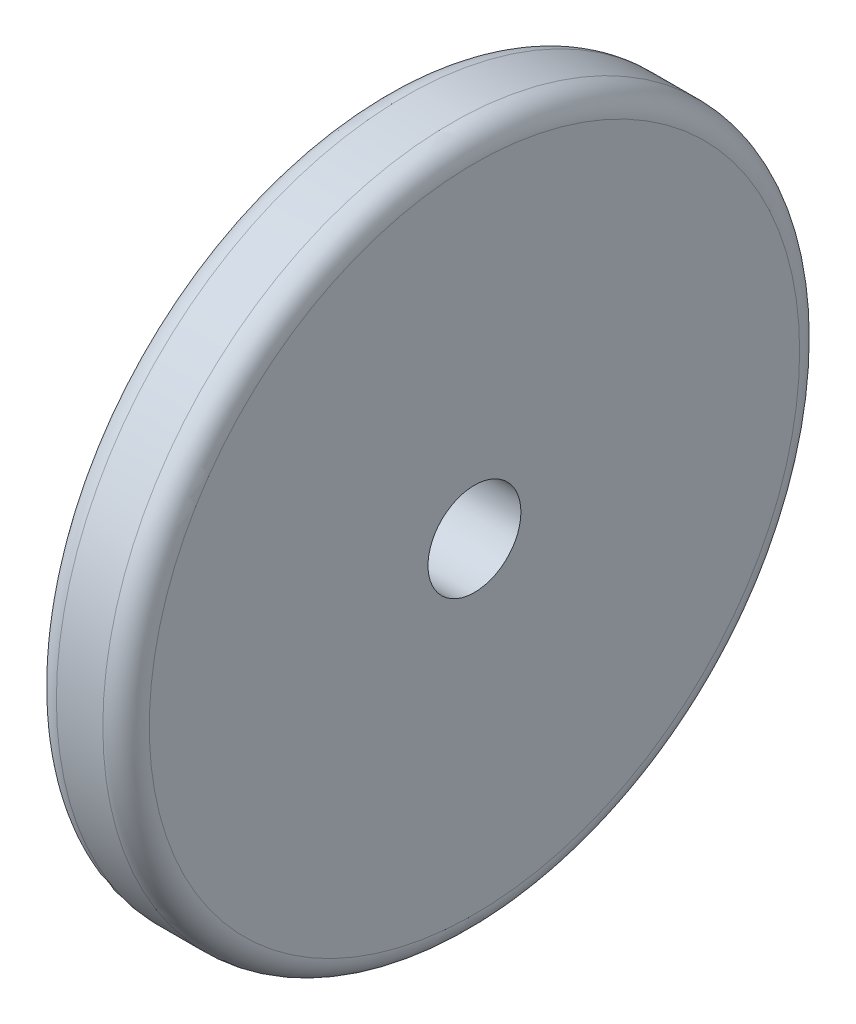
ISO-10303-21;
HEADER;
FILE_DESCRIPTION(('STEP AP214'),'2;1');
FILE_NAME('part.step','',(''),(''),'','','');
FILE_SCHEMA(('AUTOMOTIVE_DESIGN { 1 0 10303 214 1 1 1 1 }'));
ENDSEC;
DATA;
#1=APPLICATION_CONTEXT('core data for automotive mechanical design processes');
#2=APPLICATION_PROTOCOL_DEFINITION('international standard','automotive_design',2000,#1);
#3=PRODUCT_CONTEXT('',#1,'mechanical');
#4=PRODUCT('Part','Part','',(#3));
#5=PRODUCT_RELATED_PRODUCT_CATEGORY('part','',(#4));
#6=PRODUCT_DEFINITION_FORMATION('','',#4);
#7=PRODUCT_DEFINITION_CONTEXT('part definition',#1,'design');
#8=PRODUCT_DEFINITION('design','',#6,#7);
#9=PRODUCT_DEFINITION_SHAPE('','',#8);
#10=(LENGTH_UNIT() NAMED_UNIT(*) SI_UNIT(.MILLI.,.METRE.));
#11=(NAMED_UNIT(*) PLANE_ANGLE_UNIT() SI_UNIT($,.RADIAN.));
#12=(NAMED_UNIT(*) SI_UNIT($,.STERADIAN.) SOLID_ANGLE_UNIT());
#13=UNCERTAINTY_MEASURE_WITH_UNIT(LENGTH_MEASURE(1.E-05),#10,'distance_accuracy_value','');
#14=(GEOMETRIC_REPRESENTATION_CONTEXT(3) GLOBAL_UNCERTAINTY_ASSIGNED_CONTEXT((#13)) GLOBAL_UNIT_ASSIGNED_CONTEXT((#10,
#11,#12)) REPRESENTATION_CONTEXT('',''));
#15=CARTESIAN_POINT('',(0.,0.,0.));
#16=DIRECTION('',(0.,0.,1.));
#17=DIRECTION('',(1.,0.,0.));
#18=AXIS2_PLACEMENT_3D('',#15,#16,#17);
#19=CARTESIAN_POINT('',(8.,0.,0.));
#20=DIRECTION('',(-1.,0.,0.));
#21=DIRECTION('',(0.,0.,1.));
#22=AXIS2_PLACEMENT_3D('',#19,#20,#21);
#23=CYLINDRICAL_SURFACE('',#22,30.);
#24=CARTESIAN_POINT('',(6.,0.,0.));
#25=DIRECTION('',(1.,0.,0.));
#26=DIRECTION('',(0.,0.,-1.));
#27=AXIS2_PLACEMENT_3D('',#24,#25,#26);
#28=CIRCLE('',#27,30.);
#29=CARTESIAN_POINT('',(6.,0.,-30.));
#30=VERTEX_POINT('',#29);
#31=EDGE_CURVE('E40',#30,#30,#28,.F.);
#32=ORIENTED_EDGE('',*,*,#31,.T.);
#33=EDGE_LOOP('',(#32));
#34=FACE_BOUND('',#33,.T.);
#35=CARTESIAN_POINT('',(2.,0.,0.));
#36=DIRECTION('',(1.,0.,0.));
#37=DIRECTION('',(0.,0.,-1.));
#38=AXIS2_PLACEMENT_3D('',#35,#36,#37);
#39=CIRCLE('',#38,30.);
#40=CARTESIAN_POINT('',(2.,0.,-30.));
#41=VERTEX_POINT('',#40);
#42=EDGE_CURVE('E44',#41,#41,#39,.T.);
#43=ORIENTED_EDGE('',*,*,#42,.T.);
#44=EDGE_LOOP('',(#43));
#45=FACE_BOUND('',#44,.T.);
#46=ADVANCED_FACE('F33',(#34,#45),#23,.T.);
#47=CARTESIAN_POINT('',(8.,0.,0.));
#48=DIRECTION('',(1.,0.,0.));
#49=DIRECTION('',(0.,0.,-1.));
#50=AXIS2_PLACEMENT_3D('',#47,#48,#49);
#51=PLANE('',#50);
#52=CARTESIAN_POINT('',(8.,0.,0.));
#53=DIRECTION('',(1.,0.,0.));
#54=DIRECTION('',(0.,0.,-1.));
#55=AXIS2_PLACEMENT_3D('',#52,#53,#54);
#56=CIRCLE('',#55,28.);
#57=CARTESIAN_POINT('',(8.,0.,-28.));
#58=VERTEX_POINT('',#57);
#59=EDGE_CURVE('E48',#58,#58,#56,.T.);
#60=ORIENTED_EDGE('',*,*,#59,.T.);
#61=EDGE_LOOP('',(#60));
#62=FACE_BOUND('',#61,.T.);
#63=CARTESIAN_POINT('',(8.,0.,0.));
#64=DIRECTION('',(1.,0.,0.));
#65=DIRECTION('',(0.,0.,-1.));
#66=AXIS2_PLACEMENT_3D('',#63,#64,#65);
#67=CIRCLE('',#66,4.);
#68=CARTESIAN_POINT('',(8.,0.,-4.));
#69=VERTEX_POINT('',#68);
#70=EDGE_CURVE('E54',#69,#69,#67,.T.);
#71=ORIENTED_EDGE('',*,*,#70,.F.);
#72=EDGE_LOOP('',(#71));
#73=FACE_BOUND('',#72,.T.);
#74=ADVANCED_FACE('F69',(#62,#73),#51,.T.);
#75=CARTESIAN_POINT('',(0.,0.,0.));
#76=DIRECTION('',(1.,0.,0.));
#77=DIRECTION('',(0.,0.,-1.));
#78=AXIS2_PLACEMENT_3D('',#75,#76,#77);
#79=PLANE('',#78);
#80=CARTESIAN_POINT('',(0.,0.,0.));
#81=DIRECTION('',(1.,0.,0.));
#82=DIRECTION('',(0.,0.,-1.));
#83=AXIS2_PLACEMENT_3D('',#80,#81,#82);
#84=CIRCLE('',#83,28.);
#85=CARTESIAN_POINT('',(0.,0.,-28.));
#86=VERTEX_POINT('',#85);
#87=EDGE_CURVE('E10',#86,#86,#84,.F.);
#88=ORIENTED_EDGE('',*,*,#87,.T.);
#89=EDGE_LOOP('',(#88));
#90=FACE_BOUND('',#89,.T.);
#91=CARTESIAN_POINT('',(0.,0.,0.));
#92=DIRECTION('',(1.,0.,0.));
#93=DIRECTION('',(0.,0.,-1.));
#94=AXIS2_PLACEMENT_3D('',#91,#92,#93);
#95=CIRCLE('',#94,4.);
#96=CARTESIAN_POINT('',(0.,0.,-4.));
#97=VERTEX_POINT('',#96);
#98=EDGE_CURVE('E53',#97,#97,#95,.T.);
#99=ORIENTED_EDGE('',*,*,#98,.T.);
#100=EDGE_LOOP('',(#99));
#101=FACE_BOUND('',#100,.T.);
#102=ADVANCED_FACE('F60',(#90,#101),#79,.F.);
#103=CARTESIAN_POINT('',(0.,0.,0.));
#104=DIRECTION('',(1.,0.,0.));
#105=DIRECTION('',(0.,0.,-1.));
#106=AXIS2_PLACEMENT_3D('',#103,#104,#105);
#107=CYLINDRICAL_SURFACE('',#106,4.);
#108=ORIENTED_EDGE('',*,*,#98,.F.);
#109=EDGE_LOOP('',(#108));
#110=FACE_BOUND('',#109,.T.);
#111=ORIENTED_EDGE('',*,*,#70,.T.);
#112=EDGE_LOOP('',(#111));
#113=FACE_BOUND('',#112,.T.);
#114=ADVANCED_FACE('F62',(#110,#113),#107,.F.);
#115=CARTESIAN_POINT('',(6.,0.,0.));
#116=DIRECTION('',(1.,0.,0.));
#117=DIRECTION('',(0.,0.,-1.));
#118=AXIS2_PLACEMENT_3D('',#115,#116,#117);
#119=TOROIDAL_SURFACE('',#118,28.,2.);
#120=ORIENTED_EDGE('',*,*,#31,.F.);
#121=EDGE_LOOP('',(#120));
#122=FACE_BOUND('',#121,.T.);
#123=ORIENTED_EDGE('',*,*,#59,.F.);
#124=EDGE_LOOP('',(#123));
#125=FACE_BOUND('',#124,.T.);
#126=ADVANCED_FACE('F65',(#122,#125),#119,.T.);
#127=CARTESIAN_POINT('',(2.,0.,0.));
#128=DIRECTION('',(1.,0.,0.));
#129=DIRECTION('',(0.,0.,-1.));
#130=AXIS2_PLACEMENT_3D('',#127,#128,#129);
#131=TOROIDAL_SURFACE('',#130,28.,2.);
#132=ORIENTED_EDGE('',*,*,#87,.F.);
#133=EDGE_LOOP('',(#132));
#134=FACE_BOUND('',#133,.T.);
#135=ORIENTED_EDGE('',*,*,#42,.F.);
#136=EDGE_LOOP('',(#135));
#137=FACE_BOUND('',#136,.T.);
#138=ADVANCED_FACE('F35',(#134,#137),#131,.T.);
#139=CLOSED_SHELL('',(#46,#74,#102,#114,#126,#138));
#140=MANIFOLD_SOLID_BREP('B2',#139);
#141=ADVANCED_BREP_SHAPE_REPRESENTATION('',(#18,#140),#14);
#142=SHAPE_DEFINITION_REPRESENTATION(#9,#141);
ENDSEC;
END-ISO-10303-21;
